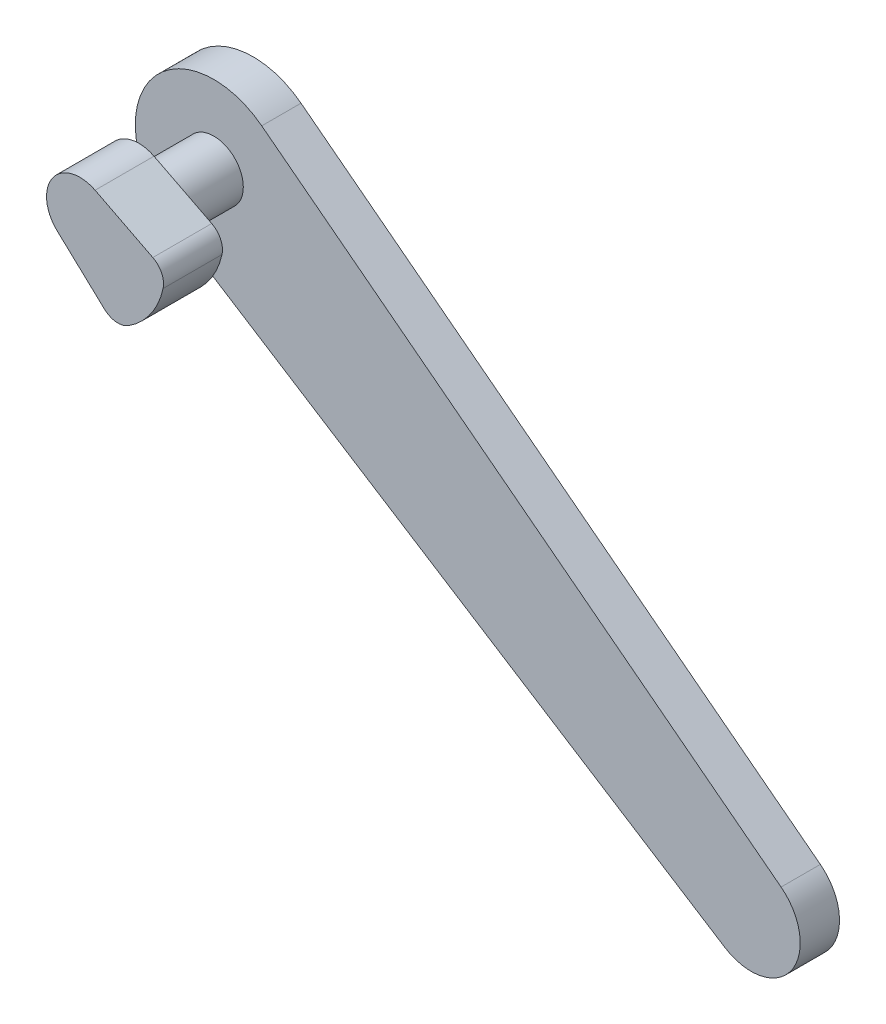
ISO-10303-21;
HEADER;
FILE_DESCRIPTION(('STEP AP214'),'2;1');
FILE_NAME('part.step','',(''),(''),'','','');
FILE_SCHEMA(('AUTOMOTIVE_DESIGN { 1 0 10303 214 1 1 1 1 }'));
ENDSEC;
DATA;
#1=APPLICATION_CONTEXT('core data for automotive mechanical design processes');
#2=APPLICATION_PROTOCOL_DEFINITION('international standard','automotive_design',2000,#1);
#3=PRODUCT_CONTEXT('',#1,'mechanical');
#4=PRODUCT('Part','Part','',(#3));
#5=PRODUCT_RELATED_PRODUCT_CATEGORY('part','',(#4));
#6=PRODUCT_DEFINITION_FORMATION('','',#4);
#7=PRODUCT_DEFINITION_CONTEXT('part definition',#1,'design');
#8=PRODUCT_DEFINITION('design','',#6,#7);
#9=PRODUCT_DEFINITION_SHAPE('','',#8);
#10=(LENGTH_UNIT() NAMED_UNIT(*) SI_UNIT(.MILLI.,.METRE.));
#11=(NAMED_UNIT(*) PLANE_ANGLE_UNIT() SI_UNIT($,.RADIAN.));
#12=(NAMED_UNIT(*) SI_UNIT($,.STERADIAN.) SOLID_ANGLE_UNIT());
#13=UNCERTAINTY_MEASURE_WITH_UNIT(LENGTH_MEASURE(1.E-05),#10,'distance_accuracy_value','');
#14=(GEOMETRIC_REPRESENTATION_CONTEXT(3) GLOBAL_UNCERTAINTY_ASSIGNED_CONTEXT((#13)) GLOBAL_UNIT_ASSIGNED_CONTEXT((#10,
#11,#12)) REPRESENTATION_CONTEXT('',''));
#15=CARTESIAN_POINT('',(0.,0.,0.));
#16=DIRECTION('',(0.,0.,1.));
#17=DIRECTION('',(1.,0.,0.));
#18=AXIS2_PLACEMENT_3D('',#15,#16,#17);
#19=CARTESIAN_POINT('',(2.4389628353503,-0.300887645857594,3.));
#20=DIRECTION('',(0.,0.,-1.));
#21=DIRECTION('',(-1.,0.,0.));
#22=AXIS2_PLACEMENT_3D('',#19,#20,#21);
#23=CYLINDRICAL_SURFACE('',#22,1.);
#24=CARTESIAN_POINT('',(2.4389628353503,-0.300887645857594,0.));
#25=DIRECTION('',(0.,0.,1.));
#26=DIRECTION('',(1.,0.,0.));
#27=AXIS2_PLACEMENT_3D('',#24,#25,#26);
#28=CIRCLE('',#27,1.);
#29=CARTESIAN_POINT('',(2.89295333508985,0.590118878330774,0.));
#30=VERTEX_POINT('',#29);
#31=CARTESIAN_POINT('',(3.41560199020059,-0.515773571905184,0.));
#32=VERTEX_POINT('',#31);
#33=EDGE_CURVE('E120',#30,#32,#28,.F.);
#34=ORIENTED_EDGE('',*,*,#33,.F.);
#35=DIRECTION('',(0.,0.,-1.));
#36=VECTOR('',#35,1.);
#37=CARTESIAN_POINT('',(2.89295333508985,0.590118878330774,3.));
#38=LINE('',#37,#36);
#39=CARTESIAN_POINT('',(2.89295333508985,0.590118878330774,3.));
#40=VERTEX_POINT('',#39);
#41=EDGE_CURVE('E11',#40,#30,#38,.T.);
#42=ORIENTED_EDGE('',*,*,#41,.F.);
#43=CARTESIAN_POINT('',(2.4389628353503,-0.300887645857594,3.));
#44=DIRECTION('',(0.,0.,1.));
#45=DIRECTION('',(1.,0.,0.));
#46=AXIS2_PLACEMENT_3D('',#43,#44,#45);
#47=CIRCLE('',#46,1.);
#48=CARTESIAN_POINT('',(3.41560199020059,-0.515773571905184,3.));
#49=VERTEX_POINT('',#48);
#50=EDGE_CURVE('E133',#40,#49,#47,.F.);
#51=ORIENTED_EDGE('',*,*,#50,.T.);
#52=DIRECTION('',(0.,0.,-1.));
#53=VECTOR('',#52,1.);
#54=CARTESIAN_POINT('',(3.41560199020059,-0.515773571905184,3.));
#55=LINE('',#54,#53);
#56=EDGE_CURVE('E81',#49,#32,#55,.T.);
#57=ORIENTED_EDGE('',*,*,#56,.T.);
#58=EDGE_LOOP('',(#34,#42,#51,#57));
#59=FACE_BOUND('',#58,.T.);
#60=ADVANCED_FACE('F35',(#59),#23,.T.);
#61=CARTESIAN_POINT('',(0.834967115212399,1.63871523206718,3.));
#62=DIRECTION('',(0.453990499739548,0.891006524188367,0.));
#63=DIRECTION('',(-0.891006524188367,0.453990499739548,0.));
#64=AXIS2_PLACEMENT_3D('',#61,#62,#63);
#65=PLANE('',#64);
#66=DIRECTION('',(0.891006524188367,-0.453990499739548,0.));
#67=VECTOR('',#66,1.);
#68=CARTESIAN_POINT('',(0.834967115212399,1.63871523206718,0.));
#69=LINE('',#68,#67);
#70=CARTESIAN_POINT('',(-0.0473681947317596,2.08828752747128,0.));
#71=VERTEX_POINT('',#70);
#72=EDGE_CURVE('E123',#71,#30,#69,.T.);
#73=ORIENTED_EDGE('',*,*,#72,.F.);
#74=DIRECTION('',(0.,0.,-1.));
#75=VECTOR('',#74,1.);
#76=CARTESIAN_POINT('',(-0.0473681947317596,2.08828752747128,3.));
#77=LINE('',#76,#75);
#78=CARTESIAN_POINT('',(-0.0473681947317596,2.08828752747128,3.));
#79=VERTEX_POINT('',#78);
#80=EDGE_CURVE('E43',#79,#71,#77,.T.);
#81=ORIENTED_EDGE('',*,*,#80,.F.);
#82=DIRECTION('',(0.891006524188367,-0.453990499739548,0.));
#83=VECTOR('',#82,1.);
#84=CARTESIAN_POINT('',(0.834967115212399,1.63871523206718,3.));
#85=LINE('',#84,#83);
#86=EDGE_CURVE('E145',#79,#40,#85,.T.);
#87=ORIENTED_EDGE('',*,*,#86,.T.);
#88=ORIENTED_EDGE('',*,*,#41,.T.);
#89=EDGE_LOOP('',(#73,#81,#87,#88));
#90=FACE_BOUND('',#89,.T.);
#91=ADVANCED_FACE('F144',(#90),#65,.T.);
#92=CARTESIAN_POINT('',(-0.819152044288994,0.573576436351052,3.));
#93=DIRECTION('',(0.,0.,-1.));
#94=DIRECTION('',(-1.,0.,0.));
#95=AXIS2_PLACEMENT_3D('',#92,#93,#94);
#96=CYLINDRICAL_SURFACE('',#95,1.70000000000001);
#97=CARTESIAN_POINT('',(-0.819152044288994,0.573576436351052,0.));
#98=DIRECTION('',(0.,0.,1.));
#99=DIRECTION('',(1.,0.,0.));
#100=AXIS2_PLACEMENT_3D('',#97,#98,#99);
#101=CIRCLE('',#100,1.70000000000001);
#102=CARTESIAN_POINT('',(-1.97854925639525,-0.669724856401543,0.));
#103=VERTEX_POINT('',#102);
#104=EDGE_CURVE('E127',#71,#103,#101,.T.);
#105=ORIENTED_EDGE('',*,*,#104,.T.);
#106=DIRECTION('',(0.,0.,-1.));
#107=VECTOR('',#106,1.);
#108=CARTESIAN_POINT('',(-1.97854925639525,-0.669724856401543,3.));
#109=LINE('',#108,#107);
#110=CARTESIAN_POINT('',(-1.97854925639525,-0.669724856401543,3.));
#111=VERTEX_POINT('',#110);
#112=EDGE_CURVE('E112',#111,#103,#109,.T.);
#113=ORIENTED_EDGE('',*,*,#112,.F.);
#114=CARTESIAN_POINT('',(-0.819152044288994,0.573576436351052,3.));
#115=DIRECTION('',(0.,0.,1.));
#116=DIRECTION('',(1.,0.,0.));
#117=AXIS2_PLACEMENT_3D('',#114,#115,#116);
#118=CIRCLE('',#117,1.70000000000001);
#119=EDGE_CURVE('E103',#79,#111,#118,.T.);
#120=ORIENTED_EDGE('',*,*,#119,.F.);
#121=ORIENTED_EDGE('',*,*,#80,.T.);
#122=EDGE_LOOP('',(#105,#113,#120,#121));
#123=FACE_BOUND('',#122,.T.);
#124=ADVANCED_FACE('F138',(#123),#96,.T.);
#125=CARTESIAN_POINT('',(-1.25431303872583,-1.34508605530556,3.));
#126=DIRECTION('',(0.6819983600625,0.731353701619169,0.));
#127=DIRECTION('',(-0.731353701619169,0.6819983600625,0.));
#128=AXIS2_PLACEMENT_3D('',#125,#126,#127);
#129=PLANE('',#128);
#130=DIRECTION('',(0.731353701619169,-0.6819983600625,0.));
#131=VECTOR('',#130,1.);
#132=CARTESIAN_POINT('',(-1.25431303872583,-1.34508605530556,0.));
#133=LINE('',#132,#131);
#134=CARTESIAN_POINT('',(0.434917958948008,-2.92031944460779,0.));
#135=VERTEX_POINT('',#134);
#136=EDGE_CURVE('E111',#103,#135,#133,.T.);
#137=ORIENTED_EDGE('',*,*,#136,.T.);
#138=DIRECTION('',(0.,0.,-1.));
#139=VECTOR('',#138,1.);
#140=CARTESIAN_POINT('',(0.434917958948008,-2.92031944460779,3.));
#141=LINE('',#140,#139);
#142=CARTESIAN_POINT('',(0.434917958948008,-2.92031944460779,3.));
#143=VERTEX_POINT('',#142);
#144=EDGE_CURVE('E108',#143,#135,#141,.T.);
#145=ORIENTED_EDGE('',*,*,#144,.F.);
#146=DIRECTION('',(0.731353701619169,-0.6819983600625,0.));
#147=VECTOR('',#146,1.);
#148=CARTESIAN_POINT('',(-1.25431303872583,-1.34508605530556,3.));
#149=LINE('',#148,#147);
#150=EDGE_CURVE('E96',#111,#143,#149,.T.);
#151=ORIENTED_EDGE('',*,*,#150,.F.);
#152=ORIENTED_EDGE('',*,*,#112,.T.);
#153=EDGE_LOOP('',(#137,#145,#151,#152));
#154=FACE_BOUND('',#153,.T.);
#155=ADVANCED_FACE('F109',(#154),#129,.F.);
#156=CARTESIAN_POINT('',(1.11691631901051,-2.18896574298862,3.));
#157=DIRECTION('',(0.,0.,-1.));
#158=DIRECTION('',(-1.,0.,0.));
#159=AXIS2_PLACEMENT_3D('',#156,#157,#158);
#160=CYLINDRICAL_SURFACE('',#159,1.);
#161=CARTESIAN_POINT('',(1.11691631901051,-2.18896574298862,0.));
#162=DIRECTION('',(0.,0.,1.));
#163=DIRECTION('',(1.,0.,0.));
#164=AXIS2_PLACEMENT_3D('',#161,#162,#163);
#165=CIRCLE('',#164,1.);
#166=CARTESIAN_POINT('',(1.65287330174753,-3.03321103474656,0.));
#167=VERTEX_POINT('',#166);
#168=EDGE_CURVE('E74',#135,#167,#165,.T.);
#169=ORIENTED_EDGE('',*,*,#168,.T.);
#170=DIRECTION('',(0.,0.,-1.));
#171=VECTOR('',#170,1.);
#172=CARTESIAN_POINT('',(1.65287330174753,-3.03321103474656,3.));
#173=LINE('',#172,#171);
#174=CARTESIAN_POINT('',(1.65287330174753,-3.03321103474656,3.));
#175=VERTEX_POINT('',#174);
#176=EDGE_CURVE('E113',#175,#167,#173,.T.);
#177=ORIENTED_EDGE('',*,*,#176,.F.);
#178=CARTESIAN_POINT('',(1.11691631901051,-2.18896574298862,3.));
#179=DIRECTION('',(0.,0.,1.));
#180=DIRECTION('',(1.,0.,0.));
#181=AXIS2_PLACEMENT_3D('',#178,#179,#180);
#182=CIRCLE('',#181,1.);
#183=EDGE_CURVE('E100',#143,#175,#182,.T.);
#184=ORIENTED_EDGE('',*,*,#183,.F.);
#185=ORIENTED_EDGE('',*,*,#144,.T.);
#186=EDGE_LOOP('',(#169,#177,#184,#185));
#187=FACE_BOUND('',#186,.T.);
#188=ADVANCED_FACE('F115',(#187),#160,.T.);
#189=CARTESIAN_POINT('',(-0.490954629200533,0.343770132285167,3.));
#190=DIRECTION('',(0.,0.,-1.));
#191=DIRECTION('',(-1.,0.,0.));
#192=AXIS2_PLACEMENT_3D('',#189,#190,#191);
#193=CYLINDRICAL_SURFACE('',#192,4.);
#194=CARTESIAN_POINT('',(-0.490954629200533,0.343770132285167,0.));
#195=DIRECTION('',(0.,0.,1.));
#196=DIRECTION('',(1.,0.,0.));
#197=AXIS2_PLACEMENT_3D('',#194,#195,#196);
#198=CIRCLE('',#197,4.);
#199=EDGE_CURVE('E131',#167,#32,#198,.T.);
#200=ORIENTED_EDGE('',*,*,#199,.T.);
#201=ORIENTED_EDGE('',*,*,#56,.F.);
#202=CARTESIAN_POINT('',(-0.490954629200533,0.343770132285167,3.));
#203=DIRECTION('',(0.,0.,1.));
#204=DIRECTION('',(1.,0.,0.));
#205=AXIS2_PLACEMENT_3D('',#202,#203,#204);
#206=CIRCLE('',#205,4.);
#207=EDGE_CURVE('E51',#175,#49,#206,.T.);
#208=ORIENTED_EDGE('',*,*,#207,.F.);
#209=ORIENTED_EDGE('',*,*,#176,.T.);
#210=EDGE_LOOP('',(#200,#201,#208,#209));
#211=FACE_BOUND('',#210,.T.);
#212=ADVANCED_FACE('F148',(#211),#193,.T.);
#213=CARTESIAN_POINT('',(0.,0.,3.));
#214=DIRECTION('',(0.,0.,1.));
#215=DIRECTION('',(1.,0.,0.));
#216=AXIS2_PLACEMENT_3D('',#213,#214,#215);
#217=PLANE('',#216);
#218=ORIENTED_EDGE('',*,*,#50,.F.);
#219=ORIENTED_EDGE('',*,*,#86,.F.);
#220=ORIENTED_EDGE('',*,*,#119,.T.);
#221=ORIENTED_EDGE('',*,*,#150,.T.);
#222=ORIENTED_EDGE('',*,*,#183,.T.);
#223=ORIENTED_EDGE('',*,*,#207,.T.);
#224=EDGE_LOOP('',(#218,#219,#220,#221,#222,#223));
#225=FACE_BOUND('',#224,.T.);
#226=ADVANCED_FACE('F98',(#225),#217,.T.);
#227=CARTESIAN_POINT('',(0.,0.,0.));
#228=DIRECTION('',(0.,0.,1.));
#229=DIRECTION('',(1.,0.,0.));
#230=AXIS2_PLACEMENT_3D('',#227,#228,#229);
#231=PLANE('',#230);
#232=CARTESIAN_POINT('',(0.,0.,0.));
#233=DIRECTION('',(0.,0.,1.));
#234=DIRECTION('',(1.,0.,0.));
#235=AXIS2_PLACEMENT_3D('',#232,#233,#234);
#236=CIRCLE('',#235,1.5);
#237=CARTESIAN_POINT('',(1.5,0.,0.));
#238=VERTEX_POINT('',#237);
#239=EDGE_CURVE('E124',#238,#238,#236,.T.);
#240=ORIENTED_EDGE('',*,*,#239,.T.);
#241=EDGE_LOOP('',(#240));
#242=FACE_BOUND('',#241,.T.);
#243=ORIENTED_EDGE('',*,*,#33,.T.);
#244=ORIENTED_EDGE('',*,*,#199,.F.);
#245=ORIENTED_EDGE('',*,*,#168,.F.);
#246=ORIENTED_EDGE('',*,*,#136,.F.);
#247=ORIENTED_EDGE('',*,*,#104,.F.);
#248=ORIENTED_EDGE('',*,*,#72,.T.);
#249=EDGE_LOOP('',(#243,#244,#245,#246,#247,#248));
#250=FACE_BOUND('',#249,.T.);
#251=ADVANCED_FACE('F143',(#242,#250),#231,.F.);
#252=CARTESIAN_POINT('',(0.,0.,-3.));
#253=DIRECTION('',(0.,0.,1.));
#254=DIRECTION('',(1.,0.,0.));
#255=AXIS2_PLACEMENT_3D('',#252,#253,#254);
#256=CYLINDRICAL_SURFACE('',#255,1.5);
#257=CARTESIAN_POINT('',(0.,0.,-3.));
#258=DIRECTION('',(0.,0.,-1.));
#259=DIRECTION('',(-1.,0.,0.));
#260=AXIS2_PLACEMENT_3D('',#257,#258,#259);
#261=CIRCLE('',#260,1.5);
#262=CARTESIAN_POINT('',(-1.5,0.,-3.));
#263=VERTEX_POINT('',#262);
#264=EDGE_CURVE('E154',#263,#263,#261,.F.);
#265=ORIENTED_EDGE('',*,*,#264,.T.);
#266=EDGE_LOOP('',(#265));
#267=FACE_BOUND('',#266,.T.);
#268=ORIENTED_EDGE('',*,*,#239,.F.);
#269=EDGE_LOOP('',(#268));
#270=FACE_BOUND('',#269,.T.);
#271=ADVANCED_FACE('F250',(#267,#270),#256,.T.);
#272=CARTESIAN_POINT('',(0.,0.,-5.));
#273=DIRECTION('',(0.,0.,1.));
#274=DIRECTION('',(1.,0.,0.));
#275=AXIS2_PLACEMENT_3D('',#272,#273,#274);
#276=CYLINDRICAL_SURFACE('',#275,4.);
#277=CARTESIAN_POINT('',(0.,0.,-3.));
#278=DIRECTION('',(0.,0.,-1.));
#279=DIRECTION('',(-1.,0.,0.));
#280=AXIS2_PLACEMENT_3D('',#277,#278,#279);
#281=CIRCLE('',#280,4.);
#282=CARTESIAN_POINT('',(-2.14484077215656,-3.37633796621352,-3.));
#283=VERTEX_POINT('',#282);
#284=CARTESIAN_POINT('',(2.43914112382643,3.17026664147651,-3.));
#285=VERTEX_POINT('',#284);
#286=EDGE_CURVE('E180',#283,#285,#281,.T.);
#287=ORIENTED_EDGE('',*,*,#286,.T.);
#288=DIRECTION('',(0.,0.,1.));
#289=VECTOR('',#288,1.);
#290=CARTESIAN_POINT('',(2.43914112382643,3.17026664147651,-5.));
#291=LINE('',#290,#289);
#292=CARTESIAN_POINT('',(2.43914112382643,3.17026664147651,-5.));
#293=VERTEX_POINT('',#292);
#294=EDGE_CURVE('E157',#293,#285,#291,.T.);
#295=ORIENTED_EDGE('',*,*,#294,.F.);
#296=CARTESIAN_POINT('',(0.,0.,-5.));
#297=DIRECTION('',(0.,0.,-1.));
#298=DIRECTION('',(-1.,0.,0.));
#299=AXIS2_PLACEMENT_3D('',#296,#297,#298);
#300=CIRCLE('',#299,4.);
#301=CARTESIAN_POINT('',(-2.14484077215656,-3.37633796621352,-5.));
#302=VERTEX_POINT('',#301);
#303=EDGE_CURVE('E173',#302,#293,#300,.T.);
#304=ORIENTED_EDGE('',*,*,#303,.F.);
#305=DIRECTION('',(0.,0.,1.));
#306=VECTOR('',#305,1.);
#307=CARTESIAN_POINT('',(-2.14484077215656,-3.37633796621352,-5.));
#308=LINE('',#307,#306);
#309=EDGE_CURVE('E166',#302,#283,#308,.T.);
#310=ORIENTED_EDGE('',*,*,#309,.T.);
#311=EDGE_LOOP('',(#287,#295,#304,#310));
#312=FACE_BOUND('',#311,.T.);
#313=ADVANCED_FACE('F204',(#312),#276,.T.);
#314=CARTESIAN_POINT('',(2.43914112382643,3.17026664147651,-5.));
#315=DIRECTION('',(-0.609785280956608,-0.792566660369127,0.));
#316=DIRECTION('',(0.792566660369127,-0.609785280956608,0.));
#317=AXIS2_PLACEMENT_3D('',#314,#315,#316);
#318=PLANE('',#317);
#319=DIRECTION('',(0.792566660369127,-0.609785280956608,0.));
#320=VECTOR('',#319,1.);
#321=CARTESIAN_POINT('',(2.43914112382643,3.17026664147651,-3.));
#322=LINE('',#321,#320);
#323=CARTESIAN_POINT('',(28.8846780790167,-17.1764120527276,-3.));
#324=VERTEX_POINT('',#323);
#325=EDGE_CURVE('E177',#285,#324,#322,.T.);
#326=ORIENTED_EDGE('',*,*,#325,.T.);
#327=DIRECTION('',(0.,0.,1.));
#328=VECTOR('',#327,1.);
#329=CARTESIAN_POINT('',(28.8846780790167,-17.1764120527276,-5.));
#330=LINE('',#329,#328);
#331=CARTESIAN_POINT('',(28.8846780790167,-17.1764120527276,-5.));
#332=VERTEX_POINT('',#331);
#333=EDGE_CURVE('E160',#332,#324,#330,.T.);
#334=ORIENTED_EDGE('',*,*,#333,.F.);
#335=DIRECTION('',(0.792566660369127,-0.609785280956608,0.));
#336=VECTOR('',#335,1.);
#337=CARTESIAN_POINT('',(2.43914112382643,3.17026664147651,-5.));
#338=LINE('',#337,#336);
#339=EDGE_CURVE('E188',#293,#332,#338,.T.);
#340=ORIENTED_EDGE('',*,*,#339,.F.);
#341=ORIENTED_EDGE('',*,*,#294,.T.);
#342=EDGE_LOOP('',(#326,#334,#340,#341));
#343=FACE_BOUND('',#342,.T.);
#344=ADVANCED_FACE('F208',(#343),#318,.F.);
#345=CARTESIAN_POINT('',(27.3602148766251,-19.1578287036505,-5.));
#346=DIRECTION('',(0.,0.,1.));
#347=DIRECTION('',(1.,0.,0.));
#348=AXIS2_PLACEMENT_3D('',#345,#346,#347);
#349=CYLINDRICAL_SURFACE('',#348,2.50000000000001);
#350=CARTESIAN_POINT('',(27.3602148766251,-19.1578287036505,-3.));
#351=DIRECTION('',(0.,0.,-1.));
#352=DIRECTION('',(-1.,0.,0.));
#353=AXIS2_PLACEMENT_3D('',#350,#351,#352);
#354=CIRCLE('',#353,2.50000000000001);
#355=CARTESIAN_POINT('',(26.0196893940273,-21.2680399325339,-3.));
#356=VERTEX_POINT('',#355);
#357=EDGE_CURVE('E174',#324,#356,#354,.T.);
#358=ORIENTED_EDGE('',*,*,#357,.T.);
#359=DIRECTION('',(0.,0.,1.));
#360=VECTOR('',#359,1.);
#361=CARTESIAN_POINT('',(26.0196893940273,-21.2680399325339,-5.));
#362=LINE('',#361,#360);
#363=CARTESIAN_POINT('',(26.0196893940273,-21.2680399325339,-5.));
#364=VERTEX_POINT('',#363);
#365=EDGE_CURVE('E163',#364,#356,#362,.T.);
#366=ORIENTED_EDGE('',*,*,#365,.F.);
#367=CARTESIAN_POINT('',(27.3602148766251,-19.1578287036505,-5.));
#368=DIRECTION('',(0.,0.,-1.));
#369=DIRECTION('',(-1.,0.,0.));
#370=AXIS2_PLACEMENT_3D('',#367,#368,#369);
#371=CIRCLE('',#370,2.50000000000001);
#372=EDGE_CURVE('E185',#332,#364,#371,.T.);
#373=ORIENTED_EDGE('',*,*,#372,.F.);
#374=ORIENTED_EDGE('',*,*,#333,.T.);
#375=EDGE_LOOP('',(#358,#366,#373,#374));
#376=FACE_BOUND('',#375,.T.);
#377=ADVANCED_FACE('F261',(#376),#349,.T.);
#378=CARTESIAN_POINT('',(-2.14484077215656,-3.37633796621352,-5.));
#379=DIRECTION('',(0.536210193039141,0.84408449155338,0.));
#380=DIRECTION('',(-0.84408449155338,0.536210193039141,0.));
#381=AXIS2_PLACEMENT_3D('',#378,#379,#380);
#382=PLANE('',#381);
#383=DIRECTION('',(-0.84408449155338,0.536210193039141,0.));
#384=VECTOR('',#383,1.);
#385=CARTESIAN_POINT('',(-2.14484077215656,-3.37633796621352,-3.));
#386=LINE('',#385,#384);
#387=EDGE_CURVE('E170',#356,#283,#386,.T.);
#388=ORIENTED_EDGE('',*,*,#387,.T.);
#389=ORIENTED_EDGE('',*,*,#309,.F.);
#390=DIRECTION('',(-0.84408449155338,0.536210193039141,0.));
#391=VECTOR('',#390,1.);
#392=CARTESIAN_POINT('',(-2.14484077215656,-3.37633796621352,-5.));
#393=LINE('',#392,#391);
#394=EDGE_CURVE('E169',#364,#302,#393,.T.);
#395=ORIENTED_EDGE('',*,*,#394,.F.);
#396=ORIENTED_EDGE('',*,*,#365,.T.);
#397=EDGE_LOOP('',(#388,#389,#395,#396));
#398=FACE_BOUND('',#397,.T.);
#399=ADVANCED_FACE('F222',(#398),#382,.F.);
#400=CARTESIAN_POINT('',(0.,0.,-5.));
#401=DIRECTION('',(0.,0.,-1.));
#402=DIRECTION('',(-1.,0.,0.));
#403=AXIS2_PLACEMENT_3D('',#400,#401,#402);
#404=PLANE('',#403);
#405=ORIENTED_EDGE('',*,*,#303,.T.);
#406=ORIENTED_EDGE('',*,*,#339,.T.);
#407=ORIENTED_EDGE('',*,*,#372,.T.);
#408=ORIENTED_EDGE('',*,*,#394,.T.);
#409=EDGE_LOOP('',(#405,#406,#407,#408));
#410=FACE_BOUND('',#409,.T.);
#411=ADVANCED_FACE('F196',(#410),#404,.T.);
#412=CARTESIAN_POINT('',(0.,0.,-3.));
#413=DIRECTION('',(0.,0.,-1.));
#414=DIRECTION('',(-1.,0.,0.));
#415=AXIS2_PLACEMENT_3D('',#412,#413,#414);
#416=PLANE('',#415);
#417=ORIENTED_EDGE('',*,*,#264,.F.);
#418=EDGE_LOOP('',(#417));
#419=FACE_BOUND('',#418,.T.);
#420=ORIENTED_EDGE('',*,*,#286,.F.);
#421=ORIENTED_EDGE('',*,*,#387,.F.);
#422=ORIENTED_EDGE('',*,*,#357,.F.);
#423=ORIENTED_EDGE('',*,*,#325,.F.);
#424=EDGE_LOOP('',(#420,#421,#422,#423));
#425=FACE_BOUND('',#424,.T.);
#426=ADVANCED_FACE('F223',(#419,#425),#416,.F.);
#427=CLOSED_SHELL('',(#60,#91,#124,#155,#188,#212,#226,#251,#271,#313,#344,#377,#399,#411,#426));
#428=MANIFOLD_SOLID_BREP('B2',#427);
#429=ADVANCED_BREP_SHAPE_REPRESENTATION('',(#18,#428),#14);
#430=SHAPE_DEFINITION_REPRESENTATION(#9,#429);
ENDSEC;
END-ISO-10303-21;
